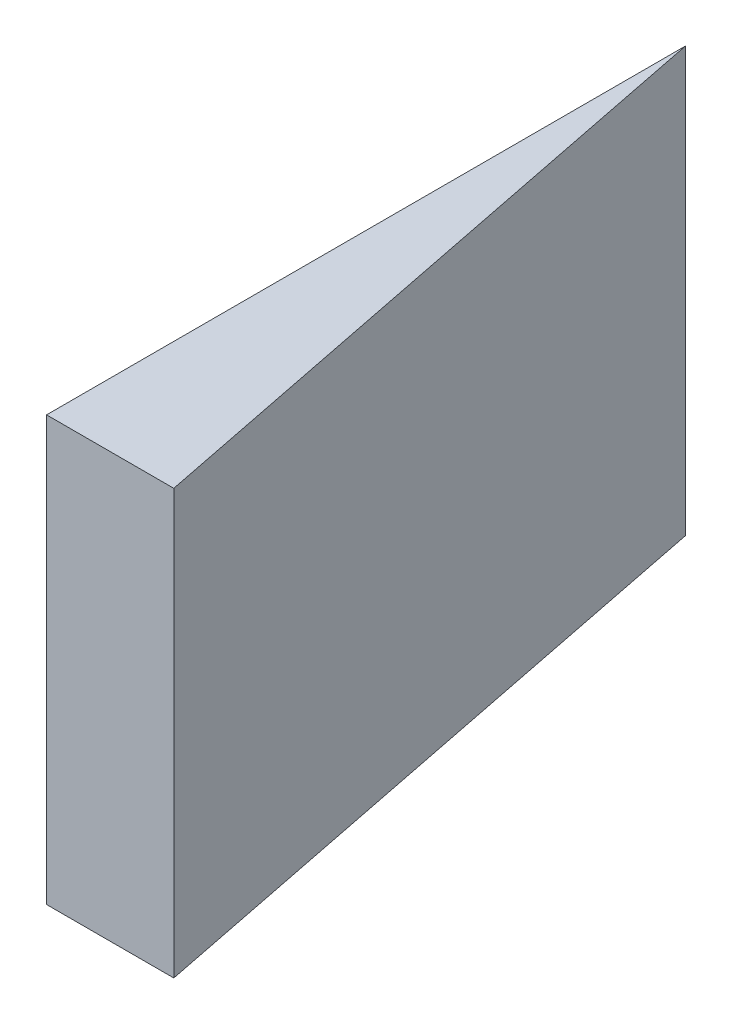
ISO-10303-21;
HEADER;
FILE_DESCRIPTION(('STEP AP214'),'2;1');
FILE_NAME('part.step','',(''),(''),'','','');
FILE_SCHEMA(('AUTOMOTIVE_DESIGN { 1 0 10303 214 1 1 1 1 }'));
ENDSEC;
DATA;
#1=APPLICATION_CONTEXT('core data for automotive mechanical design processes');
#2=APPLICATION_PROTOCOL_DEFINITION('international standard','automotive_design',2000,#1);
#3=PRODUCT_CONTEXT('',#1,'mechanical');
#4=PRODUCT('Part','Part','',(#3));
#5=PRODUCT_RELATED_PRODUCT_CATEGORY('part','',(#4));
#6=PRODUCT_DEFINITION_FORMATION('','',#4);
#7=PRODUCT_DEFINITION_CONTEXT('part definition',#1,'design');
#8=PRODUCT_DEFINITION('design','',#6,#7);
#9=PRODUCT_DEFINITION_SHAPE('','',#8);
#10=(LENGTH_UNIT() NAMED_UNIT(*) SI_UNIT(.MILLI.,.METRE.));
#11=(NAMED_UNIT(*) PLANE_ANGLE_UNIT() SI_UNIT($,.RADIAN.));
#12=(NAMED_UNIT(*) SI_UNIT($,.STERADIAN.) SOLID_ANGLE_UNIT());
#13=UNCERTAINTY_MEASURE_WITH_UNIT(LENGTH_MEASURE(1.E-05),#10,'distance_accuracy_value','');
#14=(GEOMETRIC_REPRESENTATION_CONTEXT(3) GLOBAL_UNCERTAINTY_ASSIGNED_CONTEXT((#13)) GLOBAL_UNIT_ASSIGNED_CONTEXT((#10,
#11,#12)) REPRESENTATION_CONTEXT('',''));
#15=CARTESIAN_POINT('',(0.,0.,0.));
#16=DIRECTION('',(0.,0.,1.));
#17=DIRECTION('',(1.,0.,0.));
#18=AXIS2_PLACEMENT_3D('',#15,#16,#17);
#19=CARTESIAN_POINT('',(3.37532157517584,-0.750000544852647,-5.23287728793699));
#20=DIRECTION('',(1.74845553146952E-07,1.,-8.74227765734759E-08));
#21=DIRECTION('',(-1.,1.74845553146952E-07,0.));
#22=AXIS2_PLACEMENT_3D('',#19,#20,#21);
#23=PLANE('',#22);
#24=DIRECTION('',(-0.195310522456626,-5.15899646635893E-08,-0.980741454114038));
#25=VECTOR('',#24,1.);
#26=CARTESIAN_POINT('',(3.29999986886585,-0.750000393401495,-3.65112145542899));
#27=LINE('',#26,#25);
#28=CARTESIAN_POINT('',(3.29999986886585,-0.750000393403495,-3.65112145542999));
#29=VERTEX_POINT('',#28);
#30=CARTESIAN_POINT('',(2.99999986886584,-0.750000472646483,-5.15755558162599));
#31=VERTEX_POINT('',#30);
#32=EDGE_CURVE('E11',#29,#31,#27,.T.);
#33=ORIENTED_EDGE('',*,*,#32,.T.);
#34=DIRECTION('',(0.,8.74227765663743E-08,0.999999999999996));
#35=VECTOR('',#34,1.);
#36=CARTESIAN_POINT('',(2.99999986886584,-0.750000472644483,-5.15755558162699));
#37=LINE('',#36,#35);
#38=CARTESIAN_POINT('',(2.99999986886585,-0.750000340949829,-3.65112145542899));
#39=VERTEX_POINT('',#38);
#40=EDGE_CURVE('E49',#31,#39,#37,.T.);
#41=ORIENTED_EDGE('',*,*,#40,.T.);
#42=DIRECTION('',(0.999999999999985,-1.74845553220964E-07,0.));
#43=VECTOR('',#42,1.);
#44=CARTESIAN_POINT('',(2.99999986886585,-0.750000340947829,-3.65112145542899));
#45=LINE('',#44,#43);
#46=EDGE_CURVE('E47',#39,#29,#45,.T.);
#47=ORIENTED_EDGE('',*,*,#46,.T.);
#48=EDGE_LOOP('',(#33,#41,#47));
#49=FACE_BOUND('',#48,.T.);
#50=ADVANCED_FACE('F17',(#49),#23,.T.);
#51=CARTESIAN_POINT('',(3.37532140033029,-1.75000054485365,-5.23287720051421));
#52=DIRECTION('',(1.74845553146952E-07,1.,-8.74227765734759E-08));
#53=DIRECTION('',(-1.,1.74845553146952E-07,0.));
#54=AXIS2_PLACEMENT_3D('',#51,#52,#53);
#55=PLANE('',#54);
#56=DIRECTION('',(0.999999999999985,-1.7484555285089E-07,0.));
#57=VECTOR('',#56,1.);
#58=CARTESIAN_POINT('',(2.9999996940203,-1.75000034094883,-3.65112136800621));
#59=LINE('',#58,#57);
#60=CARTESIAN_POINT('',(2.9999996940203,-1.75000034094783,-3.65112136800621));
#61=VERTEX_POINT('',#60);
#62=CARTESIAN_POINT('',(3.2999996940203,-1.75000039340149,-3.65112136800721));
#63=VERTEX_POINT('',#62);
#64=EDGE_CURVE('E24',#61,#63,#59,.T.);
#65=ORIENTED_EDGE('',*,*,#64,.F.);
#66=DIRECTION('',(0.,8.74227765663743E-08,0.999999999999996));
#67=VECTOR('',#66,1.);
#68=CARTESIAN_POINT('',(2.99999969402029,-1.75000047264548,-5.15755549420421));
#69=LINE('',#68,#67);
#70=CARTESIAN_POINT('',(2.99999969402029,-1.75000047264448,-5.15755549420321));
#71=VERTEX_POINT('',#70);
#72=EDGE_CURVE('E53',#71,#61,#69,.T.);
#73=ORIENTED_EDGE('',*,*,#72,.F.);
#74=DIRECTION('',(-0.195310522456626,-5.15899647358687E-08,-0.980741454114038));
#75=VECTOR('',#74,1.);
#76=CARTESIAN_POINT('',(3.2999996940203,-1.75000039340249,-3.65112136800621));
#77=LINE('',#76,#75);
#78=EDGE_CURVE('E68',#63,#71,#77,.T.);
#79=ORIENTED_EDGE('',*,*,#78,.F.);
#80=EDGE_LOOP('',(#65,#73,#79));
#81=FACE_BOUND('',#80,.T.);
#82=ADVANCED_FACE('F73',(#81),#55,.F.);
#83=CARTESIAN_POINT('',(3.29999986886585,-0.750000393401495,-3.65112145542899));
#84=DIRECTION('',(-0.980741454114039,1.8855287018374E-07,0.195310522456612));
#85=DIRECTION('',(-0.195310522456627,-5.15899646850099E-08,-0.980741454114042));
#86=AXIS2_PLACEMENT_3D('',#83,#84,#85);
#87=PLANE('',#86);
#88=DIRECTION('',(-1.74845553146774E-07,-0.999999999999981,8.74227765733868E-08));
#89=VECTOR('',#88,1.);
#90=CARTESIAN_POINT('',(3.29999986886585,-0.750000393401494,-3.65112145542899));
#91=LINE('',#90,#89);
#92=EDGE_CURVE('E59',#29,#63,#91,.T.);
#93=ORIENTED_EDGE('',*,*,#92,.T.);
#94=ORIENTED_EDGE('',*,*,#78,.T.);
#95=DIRECTION('',(-1.74845553146774E-07,-0.999999999999981,8.74227765733868E-08));
#96=VECTOR('',#95,1.);
#97=CARTESIAN_POINT('',(2.99999986886584,-0.750000472644483,-5.15755558162699));
#98=LINE('',#97,#96);
#99=EDGE_CURVE('E54',#31,#71,#98,.T.);
#100=ORIENTED_EDGE('',*,*,#99,.F.);
#101=ORIENTED_EDGE('',*,*,#32,.F.);
#102=EDGE_LOOP('',(#93,#94,#100,#101));
#103=FACE_BOUND('',#102,.T.);
#104=ADVANCED_FACE('F57',(#103),#87,.F.);
#105=CARTESIAN_POINT('',(2.99999986886584,-0.750000472644483,-5.15755558162699));
#106=DIRECTION('',(1.,-1.74845553146952E-07,0.));
#107=DIRECTION('',(0.,8.74227765734759E-08,1.));
#108=AXIS2_PLACEMENT_3D('',#105,#106,#107);
#109=PLANE('',#108);
#110=ORIENTED_EDGE('',*,*,#99,.T.);
#111=ORIENTED_EDGE('',*,*,#72,.T.);
#112=DIRECTION('',(-1.74845553146774E-07,-0.999999999999981,8.74227765733868E-08));
#113=VECTOR('',#112,1.);
#114=CARTESIAN_POINT('',(2.99999986886585,-0.750000340947829,-3.65112145542899));
#115=LINE('',#114,#113);
#116=EDGE_CURVE('E70',#39,#61,#115,.T.);
#117=ORIENTED_EDGE('',*,*,#116,.F.);
#118=ORIENTED_EDGE('',*,*,#40,.F.);
#119=EDGE_LOOP('',(#110,#111,#117,#118));
#120=FACE_BOUND('',#119,.T.);
#121=ADVANCED_FACE('F72',(#120),#109,.F.);
#122=CARTESIAN_POINT('',(2.99999986886585,-0.750000340947829,-3.65112145542899));
#123=DIRECTION('',(0.,-8.74227765734759E-08,-1.));
#124=DIRECTION('',(1.,-1.74845553146952E-07,0.));
#125=AXIS2_PLACEMENT_3D('',#122,#123,#124);
#126=PLANE('',#125);
#127=ORIENTED_EDGE('',*,*,#116,.T.);
#128=ORIENTED_EDGE('',*,*,#64,.T.);
#129=ORIENTED_EDGE('',*,*,#92,.F.);
#130=ORIENTED_EDGE('',*,*,#46,.F.);
#131=EDGE_LOOP('',(#127,#128,#129,#130));
#132=FACE_BOUND('',#131,.T.);
#133=ADVANCED_FACE('F61',(#132),#126,.F.);
#134=CLOSED_SHELL('',(#50,#82,#104,#121,#133));
#135=MANIFOLD_SOLID_BREP('B1',#134);
#136=ADVANCED_BREP_SHAPE_REPRESENTATION('',(#18,#135),#14);
#137=SHAPE_DEFINITION_REPRESENTATION(#9,#136);
ENDSEC;
END-ISO-10303-21;
